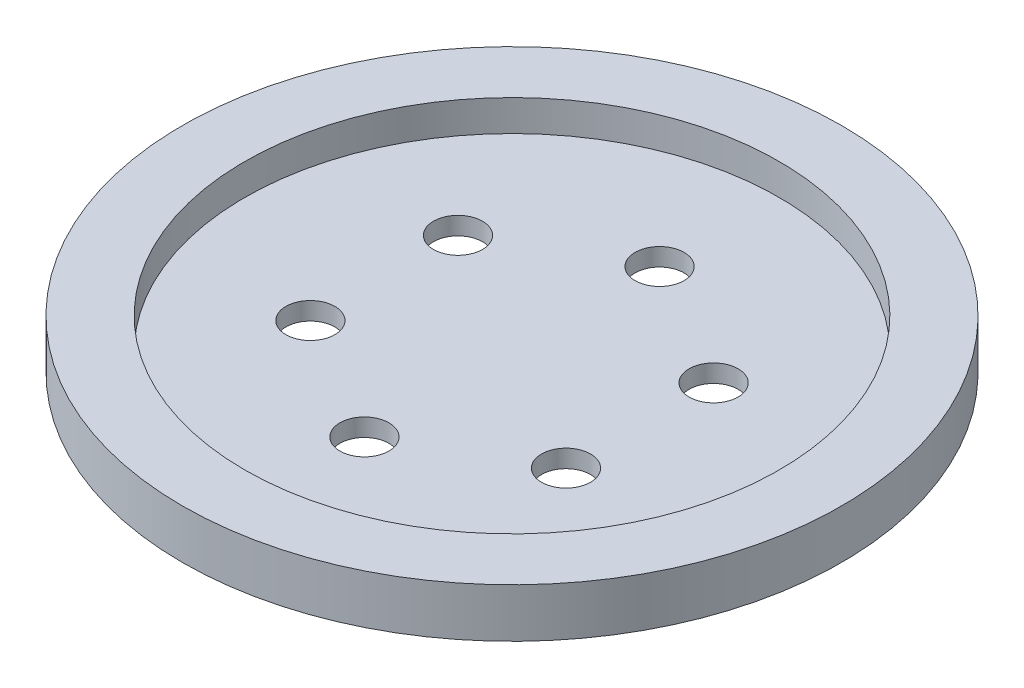
ISO-10303-21;
HEADER;
FILE_DESCRIPTION(('STEP AP214'),'2;1');
FILE_NAME('part.step','',(''),(''),'','','');
FILE_SCHEMA(('AUTOMOTIVE_DESIGN { 1 0 10303 214 1 1 1 1 }'));
ENDSEC;
DATA;
#1=APPLICATION_CONTEXT('core data for automotive mechanical design processes');
#2=APPLICATION_PROTOCOL_DEFINITION('international standard','automotive_design',2000,#1);
#3=PRODUCT_CONTEXT('',#1,'mechanical');
#4=PRODUCT('Part','Part','',(#3));
#5=PRODUCT_RELATED_PRODUCT_CATEGORY('part','',(#4));
#6=PRODUCT_DEFINITION_FORMATION('','',#4);
#7=PRODUCT_DEFINITION_CONTEXT('part definition',#1,'design');
#8=PRODUCT_DEFINITION('design','',#6,#7);
#9=PRODUCT_DEFINITION_SHAPE('','',#8);
#10=(LENGTH_UNIT() NAMED_UNIT(*) SI_UNIT(.MILLI.,.METRE.));
#11=(NAMED_UNIT(*) PLANE_ANGLE_UNIT() SI_UNIT($,.RADIAN.));
#12=(NAMED_UNIT(*) SI_UNIT($,.STERADIAN.) SOLID_ANGLE_UNIT());
#13=UNCERTAINTY_MEASURE_WITH_UNIT(LENGTH_MEASURE(1.E-05),#10,'distance_accuracy_value','');
#14=(GEOMETRIC_REPRESENTATION_CONTEXT(3) GLOBAL_UNCERTAINTY_ASSIGNED_CONTEXT((#13)) GLOBAL_UNIT_ASSIGNED_CONTEXT((#10,
#11,#12)) REPRESENTATION_CONTEXT('',''));
#15=CARTESIAN_POINT('',(0.,0.,0.));
#16=DIRECTION('',(0.,0.,1.));
#17=DIRECTION('',(1.,0.,0.));
#18=AXIS2_PLACEMENT_3D('',#15,#16,#17);
#19=CARTESIAN_POINT('',(0.,2.,0.));
#20=DIRECTION('',(0.,1.,0.));
#21=DIRECTION('',(0.,0.,1.));
#22=AXIS2_PLACEMENT_3D('',#19,#20,#21);
#23=PLANE('',#22);
#24=CARTESIAN_POINT('',(14.3500409407081,2.,-8.28500000000017));
#25=DIRECTION('',(0.,1.,0.));
#26=DIRECTION('',(0.,0.,1.));
#27=AXIS2_PLACEMENT_3D('',#24,#25,#26);
#28=CIRCLE('',#27,2.75);
#29=CARTESIAN_POINT('',(14.3500409407081,2.,-5.53500000000017));
#30=VERTEX_POINT('',#29);
#31=EDGE_CURVE('E77',#30,#30,#28,.T.);
#32=ORIENTED_EDGE('',*,*,#31,.F.);
#33=EDGE_LOOP('',(#32));
#34=FACE_BOUND('',#33,.T.);
#35=CARTESIAN_POINT('',(1.15707691569261E-13,2.,16.57));
#36=DIRECTION('',(0.,1.,0.));
#37=DIRECTION('',(0.,0.,1.));
#38=AXIS2_PLACEMENT_3D('',#35,#36,#37);
#39=CIRCLE('',#38,2.75);
#40=CARTESIAN_POINT('',(1.15707691569261E-13,2.,19.32));
#41=VERTEX_POINT('',#40);
#42=EDGE_CURVE('E65',#41,#41,#39,.T.);
#43=ORIENTED_EDGE('',*,*,#42,.F.);
#44=EDGE_LOOP('',(#43));
#45=FACE_BOUND('',#44,.T.);
#46=CARTESIAN_POINT('',(-14.3500409407082,2.,-8.28499999999997));
#47=DIRECTION('',(0.,1.,0.));
#48=DIRECTION('',(0.,0.,1.));
#49=AXIS2_PLACEMENT_3D('',#46,#47,#48);
#50=CIRCLE('',#49,2.75);
#51=CARTESIAN_POINT('',(-14.3500409407082,2.,-5.53499999999997));
#52=VERTEX_POINT('',#51);
#53=EDGE_CURVE('E54',#52,#52,#50,.T.);
#54=ORIENTED_EDGE('',*,*,#53,.F.);
#55=EDGE_LOOP('',(#54));
#56=FACE_BOUND('',#55,.T.);
#57=CARTESIAN_POINT('',(0.,2.,-16.57));
#58=DIRECTION('',(0.,1.,0.));
#59=DIRECTION('',(0.,0.,1.));
#60=AXIS2_PLACEMENT_3D('',#57,#58,#59);
#61=CIRCLE('',#60,2.75);
#62=CARTESIAN_POINT('',(0.,2.,-13.82));
#63=VERTEX_POINT('',#62);
#64=EDGE_CURVE('E46',#63,#63,#61,.T.);
#65=ORIENTED_EDGE('',*,*,#64,.F.);
#66=EDGE_LOOP('',(#65));
#67=FACE_BOUND('',#66,.T.);
#68=CARTESIAN_POINT('',(-14.3500409407081,2.,8.28500000000006));
#69=DIRECTION('',(0.,1.,0.));
#70=DIRECTION('',(0.,0.,1.));
#71=AXIS2_PLACEMENT_3D('',#68,#69,#70);
#72=CIRCLE('',#71,2.75);
#73=CARTESIAN_POINT('',(-14.3500409407081,2.,11.0350000000001));
#74=VERTEX_POINT('',#73);
#75=EDGE_CURVE('E59',#74,#74,#72,.T.);
#76=ORIENTED_EDGE('',*,*,#75,.F.);
#77=EDGE_LOOP('',(#76));
#78=FACE_BOUND('',#77,.T.);
#79=CARTESIAN_POINT('',(14.3500409407082,2.,8.28499999999987));
#80=DIRECTION('',(0.,1.,0.));
#81=DIRECTION('',(0.,0.,1.));
#82=AXIS2_PLACEMENT_3D('',#79,#80,#81);
#83=CIRCLE('',#82,2.75);
#84=CARTESIAN_POINT('',(14.3500409407082,2.,11.0349999999999));
#85=VERTEX_POINT('',#84);
#86=EDGE_CURVE('E71',#85,#85,#83,.T.);
#87=ORIENTED_EDGE('',*,*,#86,.F.);
#88=EDGE_LOOP('',(#87));
#89=FACE_BOUND('',#88,.T.);
#90=CARTESIAN_POINT('',(0.,2.,0.));
#91=DIRECTION('',(0.,1.,0.));
#92=DIRECTION('',(0.,0.,1.));
#93=AXIS2_PLACEMENT_3D('',#90,#91,#92);
#94=CIRCLE('',#93,30.);
#95=CARTESIAN_POINT('',(0.,2.,30.));
#96=VERTEX_POINT('',#95);
#97=EDGE_CURVE('E10',#96,#96,#94,.F.);
#98=ORIENTED_EDGE('',*,*,#97,.F.);
#99=EDGE_LOOP('',(#98));
#100=FACE_BOUND('',#99,.T.);
#101=ADVANCED_FACE('F35',(#34,#45,#56,#67,#78,#89,#100),#23,.T.);
#102=CARTESIAN_POINT('',(0.,0.,0.));
#103=DIRECTION('',(0.,1.,0.));
#104=DIRECTION('',(0.,0.,1.));
#105=AXIS2_PLACEMENT_3D('',#102,#103,#104);
#106=PLANE('',#105);
#107=CARTESIAN_POINT('',(0.,0.,0.));
#108=DIRECTION('',(0.,1.,0.));
#109=DIRECTION('',(0.,0.,1.));
#110=AXIS2_PLACEMENT_3D('',#107,#108,#109);
#111=CIRCLE('',#110,37.);
#112=CARTESIAN_POINT('',(0.,0.,37.));
#113=VERTEX_POINT('',#112);
#114=EDGE_CURVE('E42',#113,#113,#111,.T.);
#115=ORIENTED_EDGE('',*,*,#114,.F.);
#116=EDGE_LOOP('',(#115));
#117=FACE_BOUND('',#116,.T.);
#118=CARTESIAN_POINT('',(0.,0.,-16.57));
#119=DIRECTION('',(0.,1.,0.));
#120=DIRECTION('',(0.,0.,1.));
#121=AXIS2_PLACEMENT_3D('',#118,#119,#120);
#122=CIRCLE('',#121,2.75);
#123=CARTESIAN_POINT('',(0.,0.,-13.82));
#124=VERTEX_POINT('',#123);
#125=EDGE_CURVE('E50',#124,#124,#122,.T.);
#126=ORIENTED_EDGE('',*,*,#125,.T.);
#127=EDGE_LOOP('',(#126));
#128=FACE_BOUND('',#127,.T.);
#129=CARTESIAN_POINT('',(-14.3500409407082,0.,-8.28499999999997));
#130=DIRECTION('',(0.,1.,0.));
#131=DIRECTION('',(0.,0.,1.));
#132=AXIS2_PLACEMENT_3D('',#129,#130,#131);
#133=CIRCLE('',#132,2.75);
#134=CARTESIAN_POINT('',(-14.3500409407082,0.,-5.53499999999997));
#135=VERTEX_POINT('',#134);
#136=EDGE_CURVE('E56',#135,#135,#133,.T.);
#137=ORIENTED_EDGE('',*,*,#136,.T.);
#138=EDGE_LOOP('',(#137));
#139=FACE_BOUND('',#138,.T.);
#140=CARTESIAN_POINT('',(-14.3500409407081,0.,8.28500000000006));
#141=DIRECTION('',(0.,1.,0.));
#142=DIRECTION('',(0.,0.,1.));
#143=AXIS2_PLACEMENT_3D('',#140,#141,#142);
#144=CIRCLE('',#143,2.75);
#145=CARTESIAN_POINT('',(-14.3500409407081,0.,11.0350000000001));
#146=VERTEX_POINT('',#145);
#147=EDGE_CURVE('E62',#146,#146,#144,.T.);
#148=ORIENTED_EDGE('',*,*,#147,.T.);
#149=EDGE_LOOP('',(#148));
#150=FACE_BOUND('',#149,.T.);
#151=CARTESIAN_POINT('',(1.15707691569261E-13,0.,16.57));
#152=DIRECTION('',(0.,1.,0.));
#153=DIRECTION('',(0.,0.,1.));
#154=AXIS2_PLACEMENT_3D('',#151,#152,#153);
#155=CIRCLE('',#154,2.75);
#156=CARTESIAN_POINT('',(1.15707691569261E-13,0.,19.32));
#157=VERTEX_POINT('',#156);
#158=EDGE_CURVE('E68',#157,#157,#155,.T.);
#159=ORIENTED_EDGE('',*,*,#158,.T.);
#160=EDGE_LOOP('',(#159));
#161=FACE_BOUND('',#160,.T.);
#162=CARTESIAN_POINT('',(14.3500409407082,0.,8.28499999999987));
#163=DIRECTION('',(0.,1.,0.));
#164=DIRECTION('',(0.,0.,1.));
#165=AXIS2_PLACEMENT_3D('',#162,#163,#164);
#166=CIRCLE('',#165,2.75);
#167=CARTESIAN_POINT('',(14.3500409407082,0.,11.0349999999999));
#168=VERTEX_POINT('',#167);
#169=EDGE_CURVE('E74',#168,#168,#166,.T.);
#170=ORIENTED_EDGE('',*,*,#169,.T.);
#171=EDGE_LOOP('',(#170));
#172=FACE_BOUND('',#171,.T.);
#173=CARTESIAN_POINT('',(14.3500409407081,0.,-8.28500000000017));
#174=DIRECTION('',(0.,1.,0.));
#175=DIRECTION('',(0.,0.,1.));
#176=AXIS2_PLACEMENT_3D('',#173,#174,#175);
#177=CIRCLE('',#176,2.75);
#178=CARTESIAN_POINT('',(14.3500409407081,0.,-5.53500000000017));
#179=VERTEX_POINT('',#178);
#180=EDGE_CURVE('E80',#179,#179,#177,.T.);
#181=ORIENTED_EDGE('',*,*,#180,.T.);
#182=EDGE_LOOP('',(#181));
#183=FACE_BOUND('',#182,.T.);
#184=ADVANCED_FACE('F109',(#117,#128,#139,#150,#161,#172,#183),#106,.F.);
#185=CARTESIAN_POINT('',(0.,2.,0.));
#186=DIRECTION('',(0.,-1.,0.));
#187=DIRECTION('',(0.,0.,-1.));
#188=AXIS2_PLACEMENT_3D('',#185,#186,#187);
#189=CYLINDRICAL_SURFACE('',#188,37.);
#190=ORIENTED_EDGE('',*,*,#114,.T.);
#191=EDGE_LOOP('',(#190));
#192=FACE_BOUND('',#191,.T.);
#193=CARTESIAN_POINT('',(0.,5.5,0.));
#194=DIRECTION('',(0.,1.,0.));
#195=DIRECTION('',(0.,0.,1.));
#196=AXIS2_PLACEMENT_3D('',#193,#194,#195);
#197=CIRCLE('',#196,37.);
#198=CARTESIAN_POINT('',(0.,5.5,37.));
#199=VERTEX_POINT('',#198);
#200=EDGE_CURVE('E83',#199,#199,#197,.T.);
#201=ORIENTED_EDGE('',*,*,#200,.F.);
#202=EDGE_LOOP('',(#201));
#203=FACE_BOUND('',#202,.T.);
#204=ADVANCED_FACE('F37',(#192,#203),#189,.T.);
#205=CARTESIAN_POINT('',(0.,2.,-16.57));
#206=DIRECTION('',(0.,-1.,0.));
#207=DIRECTION('',(0.,0.,-1.));
#208=AXIS2_PLACEMENT_3D('',#205,#206,#207);
#209=CYLINDRICAL_SURFACE('',#208,2.75);
#210=ORIENTED_EDGE('',*,*,#64,.T.);
#211=EDGE_LOOP('',(#210));
#212=FACE_BOUND('',#211,.T.);
#213=ORIENTED_EDGE('',*,*,#125,.F.);
#214=EDGE_LOOP('',(#213));
#215=FACE_BOUND('',#214,.T.);
#216=ADVANCED_FACE('F121',(#212,#215),#209,.F.);
#217=CARTESIAN_POINT('',(-14.3500409407082,2.,-8.28499999999997));
#218=DIRECTION('',(0.,-1.,0.));
#219=DIRECTION('',(0.,0.,-1.));
#220=AXIS2_PLACEMENT_3D('',#217,#218,#219);
#221=CYLINDRICAL_SURFACE('',#220,2.75);
#222=ORIENTED_EDGE('',*,*,#53,.T.);
#223=EDGE_LOOP('',(#222));
#224=FACE_BOUND('',#223,.T.);
#225=ORIENTED_EDGE('',*,*,#136,.F.);
#226=EDGE_LOOP('',(#225));
#227=FACE_BOUND('',#226,.T.);
#228=ADVANCED_FACE('F124',(#224,#227),#221,.F.);
#229=CARTESIAN_POINT('',(-14.3500409407081,2.,8.28500000000006));
#230=DIRECTION('',(0.,-1.,0.));
#231=DIRECTION('',(0.,0.,-1.));
#232=AXIS2_PLACEMENT_3D('',#229,#230,#231);
#233=CYLINDRICAL_SURFACE('',#232,2.75);
#234=ORIENTED_EDGE('',*,*,#75,.T.);
#235=EDGE_LOOP('',(#234));
#236=FACE_BOUND('',#235,.T.);
#237=ORIENTED_EDGE('',*,*,#147,.F.);
#238=EDGE_LOOP('',(#237));
#239=FACE_BOUND('',#238,.T.);
#240=ADVANCED_FACE('F128',(#236,#239),#233,.F.);
#241=CARTESIAN_POINT('',(1.15707691569261E-13,2.,16.57));
#242=DIRECTION('',(0.,-1.,0.));
#243=DIRECTION('',(0.,0.,-1.));
#244=AXIS2_PLACEMENT_3D('',#241,#242,#243);
#245=CYLINDRICAL_SURFACE('',#244,2.75);
#246=ORIENTED_EDGE('',*,*,#42,.T.);
#247=EDGE_LOOP('',(#246));
#248=FACE_BOUND('',#247,.T.);
#249=ORIENTED_EDGE('',*,*,#158,.F.);
#250=EDGE_LOOP('',(#249));
#251=FACE_BOUND('',#250,.T.);
#252=ADVANCED_FACE('F132',(#248,#251),#245,.F.);
#253=CARTESIAN_POINT('',(14.3500409407082,2.,8.28499999999987));
#254=DIRECTION('',(0.,-1.,0.));
#255=DIRECTION('',(0.,0.,-1.));
#256=AXIS2_PLACEMENT_3D('',#253,#254,#255);
#257=CYLINDRICAL_SURFACE('',#256,2.75);
#258=ORIENTED_EDGE('',*,*,#86,.T.);
#259=EDGE_LOOP('',(#258));
#260=FACE_BOUND('',#259,.T.);
#261=ORIENTED_EDGE('',*,*,#169,.F.);
#262=EDGE_LOOP('',(#261));
#263=FACE_BOUND('',#262,.T.);
#264=ADVANCED_FACE('F105',(#260,#263),#257,.F.);
#265=CARTESIAN_POINT('',(14.3500409407081,2.,-8.28500000000017));
#266=DIRECTION('',(0.,-1.,0.));
#267=DIRECTION('',(0.,0.,-1.));
#268=AXIS2_PLACEMENT_3D('',#265,#266,#267);
#269=CYLINDRICAL_SURFACE('',#268,2.75);
#270=ORIENTED_EDGE('',*,*,#31,.T.);
#271=EDGE_LOOP('',(#270));
#272=FACE_BOUND('',#271,.T.);
#273=ORIENTED_EDGE('',*,*,#180,.F.);
#274=EDGE_LOOP('',(#273));
#275=FACE_BOUND('',#274,.T.);
#276=ADVANCED_FACE('F96',(#272,#275),#269,.F.);
#277=CARTESIAN_POINT('',(0.,5.5,0.));
#278=DIRECTION('',(0.,1.,0.));
#279=DIRECTION('',(0.,0.,1.));
#280=AXIS2_PLACEMENT_3D('',#277,#278,#279);
#281=PLANE('',#280);
#282=ORIENTED_EDGE('',*,*,#200,.T.);
#283=EDGE_LOOP('',(#282));
#284=FACE_BOUND('',#283,.T.);
#285=CARTESIAN_POINT('',(0.,5.5,0.));
#286=DIRECTION('',(0.,1.,0.));
#287=DIRECTION('',(0.,0.,1.));
#288=AXIS2_PLACEMENT_3D('',#285,#286,#287);
#289=CIRCLE('',#288,30.);
#290=CARTESIAN_POINT('',(0.,5.5,30.));
#291=VERTEX_POINT('',#290);
#292=EDGE_CURVE('E88',#291,#291,#289,.T.);
#293=ORIENTED_EDGE('',*,*,#292,.F.);
#294=EDGE_LOOP('',(#293));
#295=FACE_BOUND('',#294,.T.);
#296=ADVANCED_FACE('F94',(#284,#295),#281,.T.);
#297=CARTESIAN_POINT('',(0.,5.5,0.));
#298=DIRECTION('',(0.,-1.,0.));
#299=DIRECTION('',(0.,0.,-1.));
#300=AXIS2_PLACEMENT_3D('',#297,#298,#299);
#301=CYLINDRICAL_SURFACE('',#300,30.);
#302=ORIENTED_EDGE('',*,*,#292,.T.);
#303=EDGE_LOOP('',(#302));
#304=FACE_BOUND('',#303,.T.);
#305=ORIENTED_EDGE('',*,*,#97,.T.);
#306=EDGE_LOOP('',(#305));
#307=FACE_BOUND('',#306,.T.);
#308=ADVANCED_FACE('F92',(#304,#307),#301,.F.);
#309=CLOSED_SHELL('',(#101,#184,#204,#216,#228,#240,#252,#264,#276,#296,#308));
#310=MANIFOLD_SOLID_BREP('B2',#309);
#311=ADVANCED_BREP_SHAPE_REPRESENTATION('',(#18,#310),#14);
#312=SHAPE_DEFINITION_REPRESENTATION(#9,#311);
ENDSEC;
END-ISO-10303-21;
